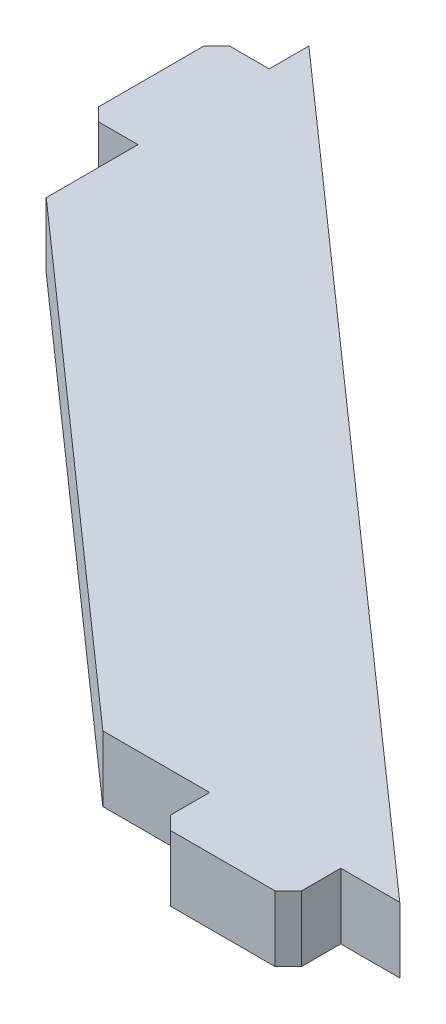
ISO-10303-21;
HEADER;
FILE_DESCRIPTION(('STEP AP214'),'2;1');
FILE_NAME('part.step','',(''),(''),'','','');
FILE_SCHEMA(('AUTOMOTIVE_DESIGN { 1 0 10303 214 1 1 1 1 }'));
ENDSEC;
DATA;
#1=APPLICATION_CONTEXT('core data for automotive mechanical design processes');
#2=APPLICATION_PROTOCOL_DEFINITION('international standard','automotive_design',2000,#1);
#3=PRODUCT_CONTEXT('',#1,'mechanical');
#4=PRODUCT('Part','Part','',(#3));
#5=PRODUCT_RELATED_PRODUCT_CATEGORY('part','',(#4));
#6=PRODUCT_DEFINITION_FORMATION('','',#4);
#7=PRODUCT_DEFINITION_CONTEXT('part definition',#1,'design');
#8=PRODUCT_DEFINITION('design','',#6,#7);
#9=PRODUCT_DEFINITION_SHAPE('','',#8);
#10=(LENGTH_UNIT() NAMED_UNIT(*) SI_UNIT(.MILLI.,.METRE.));
#11=(NAMED_UNIT(*) PLANE_ANGLE_UNIT() SI_UNIT($,.RADIAN.));
#12=(NAMED_UNIT(*) SI_UNIT($,.STERADIAN.) SOLID_ANGLE_UNIT());
#13=UNCERTAINTY_MEASURE_WITH_UNIT(LENGTH_MEASURE(1.E-05),#10,'distance_accuracy_value','');
#14=(GEOMETRIC_REPRESENTATION_CONTEXT(3) GLOBAL_UNCERTAINTY_ASSIGNED_CONTEXT((#13)) GLOBAL_UNIT_ASSIGNED_CONTEXT((#10,
#11,#12)) REPRESENTATION_CONTEXT('',''));
#15=CARTESIAN_POINT('',(0.,0.,0.));
#16=DIRECTION('',(0.,0.,1.));
#17=DIRECTION('',(1.,0.,0.));
#18=AXIS2_PLACEMENT_3D('',#15,#16,#17);
#19=CARTESIAN_POINT('',(-77.7500000000001,22.5,-11.2355769230769));
#20=DIRECTION('',(1.,0.,0.));
#21=DIRECTION('',(0.,0.,1.));
#22=AXIS2_PLACEMENT_3D('',#19,#20,#21);
#23=PLANE('',#22);
#24=DIRECTION('',(0.,0.,1.));
#25=VECTOR('',#24,1.);
#26=CARTESIAN_POINT('',(-77.7500000000001,22.5,-11.2355769230769));
#27=LINE('',#26,#25);
#28=CARTESIAN_POINT('',(-77.7500000000003,22.5,-80.1027730147436));
#29=VERTEX_POINT('',#28);
#30=CARTESIAN_POINT('',(-77.7500000000003,22.5,-66.1027730147435));
#31=VERTEX_POINT('',#30);
#32=EDGE_CURVE('E176',#29,#31,#27,.T.);
#33=ORIENTED_EDGE('',*,*,#32,.F.);
#34=CARTESIAN_POINT('',(-77.7500000000003,22.5,-80.1027730147436));
#35=CARTESIAN_POINT('',(-77.7500000000003,12.5000000000002,-80.1027730147436));
#36=B_SPLINE_CURVE_WITH_KNOTS('',1,(#34,#35),.UNSPECIFIED.,.F.,.F.,(2,2),(0.,0.166666666666667),.UNSPECIFIED.);
#37=CARTESIAN_POINT('',(-77.7500000000003,12.5000000000002,-80.1027730147436));
#38=VERTEX_POINT('',#37);
#39=EDGE_CURVE('E161',#29,#38,#36,.T.);
#40=ORIENTED_EDGE('',*,*,#39,.T.);
#41=DIRECTION('',(0.,0.,-1.));
#42=VECTOR('',#41,1.);
#43=CARTESIAN_POINT('',(-77.7500000000004,12.4999999999997,-11.2355769230771));
#44=LINE('',#43,#42);
#45=CARTESIAN_POINT('',(-77.7500000000002,12.5000000000002,-66.1027730147436));
#46=VERTEX_POINT('',#45);
#47=EDGE_CURVE('E174',#38,#46,#44,.F.);
#48=ORIENTED_EDGE('',*,*,#47,.T.);
#49=DIRECTION('',(0.,1.,0.));
#50=VECTOR('',#49,1.);
#51=CARTESIAN_POINT('',(-77.7500000000003,22.5,-66.1027730147435));
#52=LINE('',#51,#50);
#53=EDGE_CURVE('E46',#46,#31,#52,.T.);
#54=ORIENTED_EDGE('',*,*,#53,.T.);
#55=EDGE_LOOP('',(#33,#40,#48,#54));
#56=FACE_BOUND('',#55,.T.);
#57=ADVANCED_FACE('F42',(#56),#23,.F.);
#58=CARTESIAN_POINT('',(-77.7500000000004,12.5000000000002,-106.154120896643));
#59=VERTEX_POINT('',#58);
#60=CARTESIAN_POINT('',(-77.7500000000003,12.5000000000002,-100.102773014744));
#61=VERTEX_POINT('',#60);
#62=EDGE_CURVE('E186',#59,#61,#44,.F.);
#63=ORIENTED_EDGE('',*,*,#62,.T.);
#64=CARTESIAN_POINT('',(-77.7500000000003,12.5000000000002,-100.102773014744));
#65=CARTESIAN_POINT('',(-77.7500000000003,22.5,-100.102773014744));
#66=B_SPLINE_CURVE_WITH_KNOTS('',1,(#64,#65),.UNSPECIFIED.,.F.,.F.,(2,2),(0.5,
0.666666666666667),.UNSPECIFIED.);
#67=CARTESIAN_POINT('',(-77.7500000000004,22.5,-100.102773014744));
#68=VERTEX_POINT('',#67);
#69=EDGE_CURVE('E170',#61,#68,#66,.T.);
#70=ORIENTED_EDGE('',*,*,#69,.T.);
#71=CARTESIAN_POINT('',(-77.7500000000004,22.5,-106.154120896643));
#72=VERTEX_POINT('',#71);
#73=EDGE_CURVE('E242',#72,#68,#27,.T.);
#74=ORIENTED_EDGE('',*,*,#73,.F.);
#75=DIRECTION('',(0.,1.,0.));
#76=VECTOR('',#75,1.);
#77=CARTESIAN_POINT('',(-77.7500000000004,22.5,-106.154120896643));
#78=LINE('',#77,#76);
#79=EDGE_CURVE('E209',#59,#72,#78,.T.);
#80=ORIENTED_EDGE('',*,*,#79,.F.);
#81=EDGE_LOOP('',(#63,#70,#74,#80));
#82=FACE_BOUND('',#81,.T.);
#83=ADVANCED_FACE('F373',(#82),#23,.F.);
#84=CARTESIAN_POINT('',(29.562897725657,22.5,-2.0122792321331E-13));
#85=DIRECTION('',(0.,0.,-1.));
#86=DIRECTION('',(1.,0.,0.));
#87=AXIS2_PLACEMENT_3D('',#84,#85,#86);
#88=PLANE('',#87);
#89=CARTESIAN_POINT('',(33.2656032957162,12.5000000000002,0.));
#90=CARTESIAN_POINT('',(33.2656032957162,22.5,-2.28983498828939E-13));
#91=B_SPLINE_CURVE_WITH_KNOTS('',1,(#89,#90),.UNSPECIFIED.,.F.,.F.,(2,2),(0.,0.166666666666667),.UNSPECIFIED.);
#92=CARTESIAN_POINT('',(33.2656032957162,12.5000000000002,0.));
#93=VERTEX_POINT('',#92);
#94=CARTESIAN_POINT('',(33.2656032957162,22.5,-2.0122792321331E-13));
#95=VERTEX_POINT('',#94);
#96=EDGE_CURVE('E272',#93,#95,#91,.T.);
#97=ORIENTED_EDGE('',*,*,#96,.F.);
#98=DIRECTION('',(1.,0.,0.));
#99=VECTOR('',#98,1.);
#100=CARTESIAN_POINT('',(29.562897725657,12.5000000000002,0.));
#101=LINE('',#100,#99);
#102=CARTESIAN_POINT('',(42.2656032957162,12.5000000000002,1.73472347597681E-13));
#103=VERTEX_POINT('',#102);
#104=EDGE_CURVE('E206',#93,#103,#101,.T.);
#105=ORIENTED_EDGE('',*,*,#104,.T.);
#106=DIRECTION('',(0.,1.,0.));
#107=VECTOR('',#106,1.);
#108=CARTESIAN_POINT('',(42.2656032957161,22.5000000000004,0.));
#109=LINE('',#108,#107);
#110=CARTESIAN_POINT('',(42.2656032957161,22.5000000000004,0.));
#111=VERTEX_POINT('',#110);
#112=EDGE_CURVE('E52',#103,#111,#109,.T.);
#113=ORIENTED_EDGE('',*,*,#112,.T.);
#114=DIRECTION('',(1.,0.,0.));
#115=VECTOR('',#114,1.);
#116=CARTESIAN_POINT('',(29.562897725657,22.5,-2.0122792321331E-13));
#117=LINE('',#116,#115);
#118=EDGE_CURVE('E67',#95,#111,#117,.T.);
#119=ORIENTED_EDGE('',*,*,#118,.F.);
#120=EDGE_LOOP('',(#97,#105,#113,#119));
#121=FACE_BOUND('',#120,.T.);
#122=ADVANCED_FACE('F217',(#121),#88,.F.);
#123=CARTESIAN_POINT('',(13.2656032957162,22.5,-2.15105711021124E-13));
#124=CARTESIAN_POINT('',(13.2656032957162,12.5000000000002,0.));
#125=B_SPLINE_CURVE_WITH_KNOTS('',1,(#123,#124),.UNSPECIFIED.,.F.,.F.,(2,2),(0.5,
0.666666666666667),.UNSPECIFIED.);
#126=CARTESIAN_POINT('',(13.2656032957162,22.5,-1.87350135405495E-13));
#127=VERTEX_POINT('',#126);
#128=CARTESIAN_POINT('',(13.2656032957162,12.5000000000002,0.));
#129=VERTEX_POINT('',#128);
#130=EDGE_CURVE('E278',#127,#129,#125,.T.);
#131=ORIENTED_EDGE('',*,*,#130,.F.);
#132=CARTESIAN_POINT('',(-3.01560329571628,22.5000000000004,-2.0122792321331E-13));
#133=VERTEX_POINT('',#132);
#134=EDGE_CURVE('E226',#133,#127,#117,.T.);
#135=ORIENTED_EDGE('',*,*,#134,.F.);
#136=DIRECTION('',(0.,1.,0.));
#137=VECTOR('',#136,1.);
#138=CARTESIAN_POINT('',(-3.01560329571628,22.5000000000004,-2.0122792321331E-13));
#139=LINE('',#138,#137);
#140=CARTESIAN_POINT('',(-3.01560329571616,12.4999999999997,-2.28983498828939E-13));
#141=VERTEX_POINT('',#140);
#142=EDGE_CURVE('E11',#141,#133,#139,.T.);
#143=ORIENTED_EDGE('',*,*,#142,.F.);
#144=EDGE_CURVE('E203',#141,#129,#101,.T.);
#145=ORIENTED_EDGE('',*,*,#144,.T.);
#146=EDGE_LOOP('',(#131,#135,#143,#145));
#147=FACE_BOUND('',#146,.T.);
#148=ADVANCED_FACE('F396',(#147),#88,.F.);
#149=CARTESIAN_POINT('',(29.5628977256569,22.5,-11.2355769230772));
#150=DIRECTION('',(-0.6625265150438,0.,0.74903846153847));
#151=DIRECTION('',(-0.74903846153847,0.,-0.6625265150438));
#152=AXIS2_PLACEMENT_3D('',#149,#150,#151);
#153=PLANE('',#152);
#154=ORIENTED_EDGE('',*,*,#112,.F.);
#155=DIRECTION('',(-0.74903846153847,0.,-0.6625265150438));
#156=VECTOR('',#155,1.);
#157=CARTESIAN_POINT('',(29.562897725657,12.5000000000002,-11.2355769230771));
#158=LINE('',#157,#156);
#159=EDGE_CURVE('E199',#103,#59,#158,.T.);
#160=ORIENTED_EDGE('',*,*,#159,.T.);
#161=ORIENTED_EDGE('',*,*,#79,.T.);
#162=DIRECTION('',(-0.74903846153847,0.,-0.6625265150438));
#163=VECTOR('',#162,1.);
#164=CARTESIAN_POINT('',(29.5628977256569,22.5,-11.2355769230772));
#165=LINE('',#164,#163);
#166=EDGE_CURVE('E197',#111,#72,#165,.T.);
#167=ORIENTED_EDGE('',*,*,#166,.F.);
#168=EDGE_LOOP('',(#154,#160,#161,#167));
#169=FACE_BOUND('',#168,.T.);
#170=ADVANCED_FACE('F222',(#169),#153,.F.);
#171=CARTESIAN_POINT('',(9.687102274343,22.5,11.2355769230771));
#172=DIRECTION('',(-0.6625265150438,0.,0.74903846153847));
#173=DIRECTION('',(-0.74903846153847,0.,-0.6625265150438));
#174=AXIS2_PLACEMENT_3D('',#171,#172,#173);
#175=PLANE('',#174);
#176=DIRECTION('',(-0.74903846153847,0.,-0.6625265150438));
#177=VECTOR('',#176,1.);
#178=CARTESIAN_POINT('',(9.68710227434302,12.4999999999997,11.235576923077));
#179=LINE('',#178,#177);
#180=EDGE_CURVE('E184',#141,#46,#179,.T.);
#181=ORIENTED_EDGE('',*,*,#180,.F.);
#182=ORIENTED_EDGE('',*,*,#142,.T.);
#183=DIRECTION('',(-0.74903846153847,0.,-0.6625265150438));
#184=VECTOR('',#183,1.);
#185=CARTESIAN_POINT('',(9.687102274343,22.5,11.2355769230771));
#186=LINE('',#185,#184);
#187=EDGE_CURVE('E237',#133,#31,#186,.T.);
#188=ORIENTED_EDGE('',*,*,#187,.T.);
#189=ORIENTED_EDGE('',*,*,#53,.F.);
#190=EDGE_LOOP('',(#181,#182,#188,#189));
#191=FACE_BOUND('',#190,.T.);
#192=ADVANCED_FACE('F44',(#191),#175,.T.);
#193=CARTESIAN_POINT('',(29.5628977256569,22.5,-11.2355769230772));
#194=DIRECTION('',(0.,-1.,0.));
#195=DIRECTION('',(0.,0.,-1.));
#196=AXIS2_PLACEMENT_3D('',#193,#194,#195);
#197=PLANE('',#196);
#198=ORIENTED_EDGE('',*,*,#73,.T.);
#199=DIRECTION('',(1.,0.,0.));
#200=VECTOR('',#199,1.);
#201=CARTESIAN_POINT('',(-93.7500000000005,22.5,-100.102773014744));
#202=LINE('',#201,#200);
#203=CARTESIAN_POINT('',(-83.7500000000004,22.5,-100.102773014744));
#204=VERTEX_POINT('',#203);
#205=EDGE_CURVE('E59',#204,#68,#202,.T.);
#206=ORIENTED_EDGE('',*,*,#205,.F.);
#207=DIRECTION('',(-0.707106781186545,0.,0.70710678118655));
#208=VECTOR('',#207,1.);
#209=CARTESIAN_POINT('',(-88.7500000000004,22.5,-95.1027730147436));
#210=LINE('',#209,#208);
#211=CARTESIAN_POINT('',(-85.7500000000004,22.5,-98.1027730147436));
#212=VERTEX_POINT('',#211);
#213=EDGE_CURVE('E309',#204,#212,#210,.T.);
#214=ORIENTED_EDGE('',*,*,#213,.T.);
#215=DIRECTION('',(0.,0.,-1.));
#216=VECTOR('',#215,1.);
#217=CARTESIAN_POINT('',(-85.7500000000004,22.5,-100.102773014744));
#218=LINE('',#217,#216);
#219=CARTESIAN_POINT('',(-85.7500000000003,22.5,-82.1027730147435));
#220=VERTEX_POINT('',#219);
#221=EDGE_CURVE('E335',#220,#212,#218,.T.);
#222=ORIENTED_EDGE('',*,*,#221,.F.);
#223=DIRECTION('',(0.70710678118655,0.,0.707106781186545));
#224=VECTOR('',#223,1.);
#225=CARTESIAN_POINT('',(-98.7500000000004,22.5,-95.1027730147436));
#226=LINE('',#225,#224);
#227=CARTESIAN_POINT('',(-83.7500000000003,22.5,-80.1027730147435));
#228=VERTEX_POINT('',#227);
#229=EDGE_CURVE('E312',#220,#228,#226,.T.);
#230=ORIENTED_EDGE('',*,*,#229,.T.);
#231=DIRECTION('',(1.,0.,0.));
#232=VECTOR('',#231,1.);
#233=CARTESIAN_POINT('',(-93.7500000000005,22.5,-80.1027730147435));
#234=LINE('',#233,#232);
#235=EDGE_CURVE('E341',#228,#29,#234,.T.);
#236=ORIENTED_EDGE('',*,*,#235,.T.);
#237=ORIENTED_EDGE('',*,*,#32,.T.);
#238=ORIENTED_EDGE('',*,*,#187,.F.);
#239=ORIENTED_EDGE('',*,*,#134,.T.);
#240=DIRECTION('',(0.,0.,-1.));
#241=VECTOR('',#240,1.);
#242=CARTESIAN_POINT('',(13.2656032957162,22.5,16.));
#243=LINE('',#242,#241);
#244=CARTESIAN_POINT('',(13.2656032957162,22.5,5.99999999999998));
#245=VERTEX_POINT('',#244);
#246=EDGE_CURVE('E279',#245,#127,#243,.T.);
#247=ORIENTED_EDGE('',*,*,#246,.F.);
#248=DIRECTION('',(0.707106781186548,0.,0.707106781186548));
#249=VECTOR('',#248,1.);
#250=CARTESIAN_POINT('',(15.2656032957162,22.5,8.00000000000003));
#251=LINE('',#250,#249);
#252=CARTESIAN_POINT('',(15.2656032957162,22.5,8.));
#253=VERTEX_POINT('',#252);
#254=EDGE_CURVE('E193',#245,#253,#251,.T.);
#255=ORIENTED_EDGE('',*,*,#254,.T.);
#256=DIRECTION('',(-1.,0.,0.));
#257=VECTOR('',#256,1.);
#258=CARTESIAN_POINT('',(33.2656032957162,22.5,8.));
#259=LINE('',#258,#257);
#260=CARTESIAN_POINT('',(31.2656032957162,22.5,8.00000000000001));
#261=VERTEX_POINT('',#260);
#262=EDGE_CURVE('E267',#261,#253,#259,.T.);
#263=ORIENTED_EDGE('',*,*,#262,.F.);
#264=DIRECTION('',(0.707106781186548,0.,-0.707106781186547));
#265=VECTOR('',#264,1.);
#266=CARTESIAN_POINT('',(31.2656032957161,22.5,8.00000000000005));
#267=LINE('',#266,#265);
#268=CARTESIAN_POINT('',(33.2656032957162,22.5,5.9999999999998));
#269=VERTEX_POINT('',#268);
#270=EDGE_CURVE('E247',#261,#269,#267,.T.);
#271=ORIENTED_EDGE('',*,*,#270,.T.);
#272=DIRECTION('',(0.,0.,-1.));
#273=VECTOR('',#272,1.);
#274=CARTESIAN_POINT('',(33.2656032957162,22.5,16.));
#275=LINE('',#274,#273);
#276=EDGE_CURVE('E282',#269,#95,#275,.T.);
#277=ORIENTED_EDGE('',*,*,#276,.T.);
#278=ORIENTED_EDGE('',*,*,#118,.T.);
#279=ORIENTED_EDGE('',*,*,#166,.T.);
#280=EDGE_LOOP('',(#198,#206,#214,#222,#230,#236,#237,#238,#239,#247,#255,#263,#271,#277,#278,#279));
#281=FACE_BOUND('',#280,.T.);
#282=ADVANCED_FACE('F398',(#281),#197,.F.);
#283=CARTESIAN_POINT('',(29.562897725657,12.5000000000002,-11.2355769230771));
#284=DIRECTION('',(0.,-1.,0.));
#285=DIRECTION('',(0.,0.,-1.));
#286=AXIS2_PLACEMENT_3D('',#283,#284,#285);
#287=PLANE('',#286);
#288=ORIENTED_EDGE('',*,*,#62,.F.);
#289=ORIENTED_EDGE('',*,*,#159,.F.);
#290=ORIENTED_EDGE('',*,*,#104,.F.);
#291=DIRECTION('',(0.,0.,-1.));
#292=VECTOR('',#291,1.);
#293=CARTESIAN_POINT('',(33.265603295716,12.5000000000002,16.0000000000001));
#294=LINE('',#293,#292);
#295=CARTESIAN_POINT('',(33.2656032957162,12.5000000000002,6.));
#296=VERTEX_POINT('',#295);
#297=EDGE_CURVE('E268',#296,#93,#294,.T.);
#298=ORIENTED_EDGE('',*,*,#297,.F.);
#299=DIRECTION('',(-0.707106781186548,0.,0.707106781186547));
#300=VECTOR('',#299,1.);
#301=CARTESIAN_POINT('',(31.2656032957161,12.5000000000002,8.00000000000003));
#302=LINE('',#301,#300);
#303=CARTESIAN_POINT('',(31.2656032957162,12.5000000000002,8.00000000000002));
#304=VERTEX_POINT('',#303);
#305=EDGE_CURVE('E256',#296,#304,#302,.T.);
#306=ORIENTED_EDGE('',*,*,#305,.T.);
#307=DIRECTION('',(1.,0.,0.));
#308=VECTOR('',#307,1.);
#309=CARTESIAN_POINT('',(13.2656032957162,12.5000000000002,8.));
#310=LINE('',#309,#308);
#311=CARTESIAN_POINT('',(15.2656032957162,12.5000000000002,8.));
#312=VERTEX_POINT('',#311);
#313=EDGE_CURVE('E277',#312,#304,#310,.T.);
#314=ORIENTED_EDGE('',*,*,#313,.F.);
#315=DIRECTION('',(-0.707106781186548,0.,-0.707106781186548));
#316=VECTOR('',#315,1.);
#317=CARTESIAN_POINT('',(15.2656032957162,12.5000000000002,8.00000000000001));
#318=LINE('',#317,#316);
#319=CARTESIAN_POINT('',(13.2656032957162,12.5000000000002,6.));
#320=VERTEX_POINT('',#319);
#321=EDGE_CURVE('E253',#312,#320,#318,.T.);
#322=ORIENTED_EDGE('',*,*,#321,.T.);
#323=DIRECTION('',(0.,0.,-1.));
#324=VECTOR('',#323,1.);
#325=CARTESIAN_POINT('',(13.2656032957162,12.5000000000002,16.));
#326=LINE('',#325,#324);
#327=EDGE_CURVE('E273',#320,#129,#326,.T.);
#328=ORIENTED_EDGE('',*,*,#327,.T.);
#329=ORIENTED_EDGE('',*,*,#144,.F.);
#330=ORIENTED_EDGE('',*,*,#180,.T.);
#331=ORIENTED_EDGE('',*,*,#47,.F.);
#332=DIRECTION('',(1.,0.,0.));
#333=VECTOR('',#332,1.);
#334=CARTESIAN_POINT('',(-93.7500000000004,12.5000000000002,-80.1027730147435));
#335=LINE('',#334,#333);
#336=CARTESIAN_POINT('',(-83.7500000000003,12.5000000000002,-80.1027730147435));
#337=VERTEX_POINT('',#336);
#338=EDGE_CURVE('E157',#337,#38,#335,.T.);
#339=ORIENTED_EDGE('',*,*,#338,.F.);
#340=DIRECTION('',(-0.70710678118655,0.,-0.707106781186545));
#341=VECTOR('',#340,1.);
#342=CARTESIAN_POINT('',(-88.7500000000004,12.5000000000002,-85.1027730147436));
#343=LINE('',#342,#341);
#344=CARTESIAN_POINT('',(-85.7500000000003,12.5000000000002,-82.1027730147435));
#345=VERTEX_POINT('',#344);
#346=EDGE_CURVE('E321',#337,#345,#343,.T.);
#347=ORIENTED_EDGE('',*,*,#346,.T.);
#348=DIRECTION('',(0.,0.,1.));
#349=VECTOR('',#348,1.);
#350=CARTESIAN_POINT('',(-85.7500000000003,12.5000000000002,-80.1027730147435));
#351=LINE('',#350,#349);
#352=CARTESIAN_POINT('',(-85.7500000000004,12.5000000000002,-98.1027730147436));
#353=VERTEX_POINT('',#352);
#354=EDGE_CURVE('E332',#353,#345,#351,.T.);
#355=ORIENTED_EDGE('',*,*,#354,.F.);
#356=DIRECTION('',(0.707106781186545,0.,-0.70710678118655));
#357=VECTOR('',#356,1.);
#358=CARTESIAN_POINT('',(-98.7500000000004,12.5000000000002,-85.1027730147434));
#359=LINE('',#358,#357);
#360=CARTESIAN_POINT('',(-83.7500000000004,12.5000000000002,-100.102773014744));
#361=VERTEX_POINT('',#360);
#362=EDGE_CURVE('E318',#353,#361,#359,.T.);
#363=ORIENTED_EDGE('',*,*,#362,.T.);
#364=DIRECTION('',(1.,0.,0.));
#365=VECTOR('',#364,1.);
#366=CARTESIAN_POINT('',(-93.7500000000004,12.5000000000002,-100.102773014744));
#367=LINE('',#366,#365);
#368=EDGE_CURVE('E169',#361,#61,#367,.T.);
#369=ORIENTED_EDGE('',*,*,#368,.T.);
#370=EDGE_LOOP('',(#288,#289,#290,#298,#306,#314,#322,#328,#329,#330,#331,#339,#347,#355,#363,#369));
#371=FACE_BOUND('',#370,.T.);
#372=ADVANCED_FACE('F181',(#371),#287,.T.);
#373=CARTESIAN_POINT('',(33.265603295716,12.5000000000002,16.0000000000001));
#374=DIRECTION('',(-1.,0.,0.));
#375=DIRECTION('',(0.,0.,1.));
#376=AXIS2_PLACEMENT_3D('',#373,#374,#375);
#377=PLANE('',#376);
#378=ORIENTED_EDGE('',*,*,#276,.F.);
#379=DIRECTION('',(0.,-1.,0.));
#380=VECTOR('',#379,1.);
#381=CARTESIAN_POINT('',(33.2656032957162,12.5000000000002,6.));
#382=LINE('',#381,#380);
#383=EDGE_CURVE('E187',#269,#296,#382,.T.);
#384=ORIENTED_EDGE('',*,*,#383,.T.);
#385=ORIENTED_EDGE('',*,*,#297,.T.);
#386=ORIENTED_EDGE('',*,*,#96,.T.);
#387=EDGE_LOOP('',(#378,#384,#385,#386));
#388=FACE_BOUND('',#387,.T.);
#389=ADVANCED_FACE('F378',(#388),#377,.F.);
#390=CARTESIAN_POINT('',(13.2656032957162,22.5,16.));
#391=DIRECTION('',(1.,0.,0.));
#392=DIRECTION('',(0.,0.,-1.));
#393=AXIS2_PLACEMENT_3D('',#390,#391,#392);
#394=PLANE('',#393);
#395=ORIENTED_EDGE('',*,*,#327,.F.);
#396=DIRECTION('',(0.,1.,0.));
#397=VECTOR('',#396,1.);
#398=CARTESIAN_POINT('',(13.2656032957162,22.5,5.99999999999998));
#399=LINE('',#398,#397);
#400=EDGE_CURVE('E250',#320,#245,#399,.T.);
#401=ORIENTED_EDGE('',*,*,#400,.T.);
#402=ORIENTED_EDGE('',*,*,#246,.T.);
#403=ORIENTED_EDGE('',*,*,#130,.T.);
#404=EDGE_LOOP('',(#395,#401,#402,#403));
#405=FACE_BOUND('',#404,.T.);
#406=ADVANCED_FACE('F394',(#405),#394,.F.);
#407=CARTESIAN_POINT('',(0.,0.,7.9999999999999));
#408=DIRECTION('',(0.,0.,1.));
#409=DIRECTION('',(1.,0.,0.));
#410=AXIS2_PLACEMENT_3D('',#407,#408,#409);
#411=PLANE('',#410);
#412=ORIENTED_EDGE('',*,*,#262,.T.);
#413=DIRECTION('',(0.,-1.,0.));
#414=VECTOR('',#413,1.);
#415=CARTESIAN_POINT('',(15.2656032957162,12.5000000000002,8.));
#416=LINE('',#415,#414);
#417=EDGE_CURVE('E259',#253,#312,#416,.T.);
#418=ORIENTED_EDGE('',*,*,#417,.T.);
#419=ORIENTED_EDGE('',*,*,#313,.T.);
#420=DIRECTION('',(0.,1.,0.));
#421=VECTOR('',#420,1.);
#422=CARTESIAN_POINT('',(31.2656032957162,22.5,8.00000000000001));
#423=LINE('',#422,#421);
#424=EDGE_CURVE('E263',#304,#261,#423,.T.);
#425=ORIENTED_EDGE('',*,*,#424,.T.);
#426=EDGE_LOOP('',(#412,#418,#419,#425));
#427=FACE_BOUND('',#426,.T.);
#428=ADVANCED_FACE('F385',(#427),#411,.T.);
#429=CARTESIAN_POINT('',(15.2656032957162,0.,8.));
#430=DIRECTION('',(-0.707106781186548,0.,0.707106781186548));
#431=DIRECTION('',(0.,1.,0.));
#432=AXIS2_PLACEMENT_3D('',#429,#430,#431);
#433=PLANE('',#432);
#434=ORIENTED_EDGE('',*,*,#254,.F.);
#435=ORIENTED_EDGE('',*,*,#400,.F.);
#436=ORIENTED_EDGE('',*,*,#321,.F.);
#437=ORIENTED_EDGE('',*,*,#417,.F.);
#438=EDGE_LOOP('',(#434,#435,#436,#437));
#439=FACE_BOUND('',#438,.T.);
#440=ADVANCED_FACE('F390',(#439),#433,.T.);
#441=CARTESIAN_POINT('',(31.2656032957162,0.,8.));
#442=DIRECTION('',(0.707106781186547,0.,0.707106781186548));
#443=DIRECTION('',(0.,-1.,0.));
#444=AXIS2_PLACEMENT_3D('',#441,#442,#443);
#445=PLANE('',#444);
#446=ORIENTED_EDGE('',*,*,#305,.F.);
#447=ORIENTED_EDGE('',*,*,#383,.F.);
#448=ORIENTED_EDGE('',*,*,#270,.F.);
#449=ORIENTED_EDGE('',*,*,#424,.F.);
#450=EDGE_LOOP('',(#446,#447,#448,#449));
#451=FACE_BOUND('',#450,.T.);
#452=ADVANCED_FACE('F381',(#451),#445,.T.);
#453=CARTESIAN_POINT('',(-93.7500000000005,22.5,-80.1027730147435));
#454=DIRECTION('',(0.,0.,1.));
#455=DIRECTION('',(1.,0.,0.));
#456=AXIS2_PLACEMENT_3D('',#453,#454,#455);
#457=PLANE('',#456);
#458=ORIENTED_EDGE('',*,*,#235,.F.);
#459=DIRECTION('',(0.,-1.,0.));
#460=VECTOR('',#459,1.);
#461=CARTESIAN_POINT('',(-83.7500000000003,12.5000000000002,-80.1027730147435));
#462=LINE('',#461,#460);
#463=EDGE_CURVE('E164',#228,#337,#462,.T.);
#464=ORIENTED_EDGE('',*,*,#463,.T.);
#465=ORIENTED_EDGE('',*,*,#338,.T.);
#466=ORIENTED_EDGE('',*,*,#39,.F.);
#467=EDGE_LOOP('',(#458,#464,#465,#466));
#468=FACE_BOUND('',#467,.T.);
#469=ADVANCED_FACE('F160',(#468),#457,.T.);
#470=CARTESIAN_POINT('',(-93.7500000000004,12.5000000000002,-100.102773014744));
#471=DIRECTION('',(0.,0.,-1.));
#472=DIRECTION('',(-1.,0.,0.));
#473=AXIS2_PLACEMENT_3D('',#470,#471,#472);
#474=PLANE('',#473);
#475=ORIENTED_EDGE('',*,*,#368,.F.);
#476=DIRECTION('',(0.,1.,0.));
#477=VECTOR('',#476,1.);
#478=CARTESIAN_POINT('',(-83.7500000000004,22.5,-100.102773014744));
#479=LINE('',#478,#477);
#480=EDGE_CURVE('E315',#361,#204,#479,.T.);
#481=ORIENTED_EDGE('',*,*,#480,.T.);
#482=ORIENTED_EDGE('',*,*,#205,.T.);
#483=ORIENTED_EDGE('',*,*,#69,.F.);
#484=EDGE_LOOP('',(#475,#481,#482,#483));
#485=FACE_BOUND('',#484,.T.);
#486=ADVANCED_FACE('F371',(#485),#474,.T.);
#487=CARTESIAN_POINT('',(-85.75,0.,1.04083408558608E-13));
#488=DIRECTION('',(1.,0.,0.));
#489=DIRECTION('',(0.,0.,-1.));
#490=AXIS2_PLACEMENT_3D('',#487,#488,#489);
#491=PLANE('',#490);
#492=ORIENTED_EDGE('',*,*,#221,.T.);
#493=DIRECTION('',(0.,-1.,0.));
#494=VECTOR('',#493,1.);
#495=CARTESIAN_POINT('',(-85.7500000000004,12.5000000000002,-98.1027730147436));
#496=LINE('',#495,#494);
#497=EDGE_CURVE('E324',#212,#353,#496,.T.);
#498=ORIENTED_EDGE('',*,*,#497,.T.);
#499=ORIENTED_EDGE('',*,*,#354,.T.);
#500=DIRECTION('',(0.,1.,0.));
#501=VECTOR('',#500,1.);
#502=CARTESIAN_POINT('',(-85.7500000000003,22.5,-82.1027730147435));
#503=LINE('',#502,#501);
#504=EDGE_CURVE('E328',#345,#220,#503,.T.);
#505=ORIENTED_EDGE('',*,*,#504,.T.);
#506=EDGE_LOOP('',(#492,#498,#499,#505));
#507=FACE_BOUND('',#506,.T.);
#508=ADVANCED_FACE('F363',(#507),#491,.F.);
#509=CARTESIAN_POINT('',(-85.7500000000004,0.,-98.1027730147436));
#510=DIRECTION('',(-0.70710678118655,0.,-0.707106781186545));
#511=DIRECTION('',(0.,1.,0.));
#512=AXIS2_PLACEMENT_3D('',#509,#510,#511);
#513=PLANE('',#512);
#514=ORIENTED_EDGE('',*,*,#213,.F.);
#515=ORIENTED_EDGE('',*,*,#480,.F.);
#516=ORIENTED_EDGE('',*,*,#362,.F.);
#517=ORIENTED_EDGE('',*,*,#497,.F.);
#518=EDGE_LOOP('',(#514,#515,#516,#517));
#519=FACE_BOUND('',#518,.T.);
#520=ADVANCED_FACE('F368',(#519),#513,.T.);
#521=CARTESIAN_POINT('',(-85.7500000000003,0.,-82.1027730147435));
#522=DIRECTION('',(-0.707106781186545,0.,0.70710678118655));
#523=DIRECTION('',(0.,-1.,0.));
#524=AXIS2_PLACEMENT_3D('',#521,#522,#523);
#525=PLANE('',#524);
#526=ORIENTED_EDGE('',*,*,#346,.F.);
#527=ORIENTED_EDGE('',*,*,#463,.F.);
#528=ORIENTED_EDGE('',*,*,#229,.F.);
#529=ORIENTED_EDGE('',*,*,#504,.F.);
#530=EDGE_LOOP('',(#526,#527,#528,#529));
#531=FACE_BOUND('',#530,.T.);
#532=ADVANCED_FACE('F403',(#531),#525,.T.);
#533=CLOSED_SHELL('',(#57,#83,#122,#148,#170,#192,#282,#372,#389,#406,#428,#440,#452,#469,#486,
#508,#520,#532));
#534=MANIFOLD_SOLID_BREP('B2',#533);
#535=ADVANCED_BREP_SHAPE_REPRESENTATION('',(#18,#534),#14);
#536=SHAPE_DEFINITION_REPRESENTATION(#9,#535);
ENDSEC;
END-ISO-10303-21;
